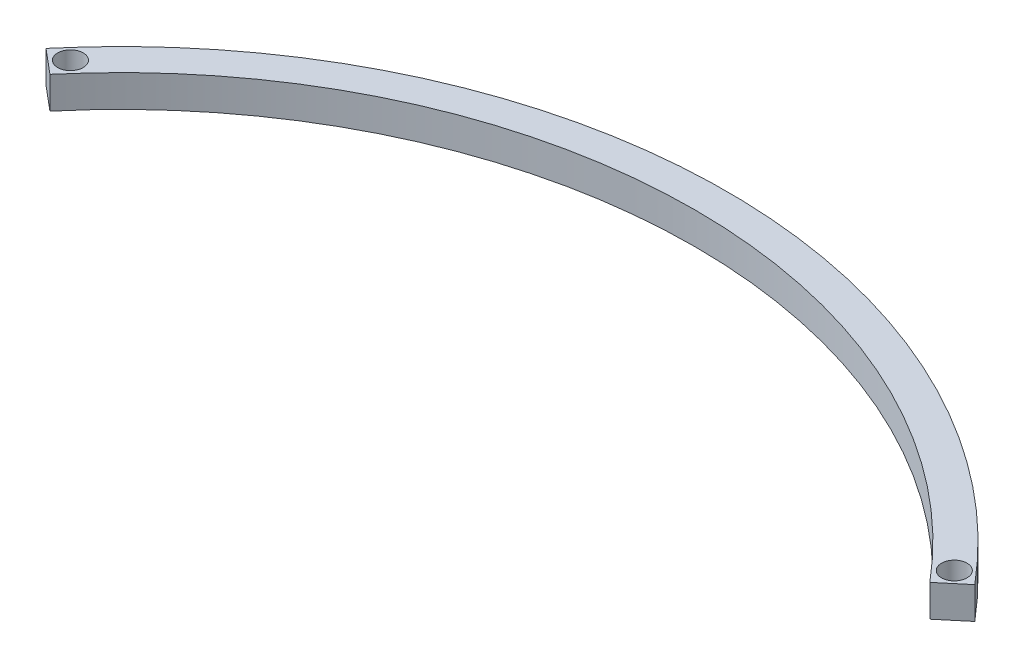
ISO-10303-21;
HEADER;
FILE_DESCRIPTION(('STEP AP214'),'2;1');
FILE_NAME('part.step','',(''),(''),'','','');
FILE_SCHEMA(('AUTOMOTIVE_DESIGN { 1 0 10303 214 1 1 1 1 }'));
ENDSEC;
DATA;
#1=APPLICATION_CONTEXT('core data for automotive mechanical design processes');
#2=APPLICATION_PROTOCOL_DEFINITION('international standard','automotive_design',2000,#1);
#3=PRODUCT_CONTEXT('',#1,'mechanical');
#4=PRODUCT('Part','Part','',(#3));
#5=PRODUCT_RELATED_PRODUCT_CATEGORY('part','',(#4));
#6=PRODUCT_DEFINITION_FORMATION('','',#4);
#7=PRODUCT_DEFINITION_CONTEXT('part definition',#1,'design');
#8=PRODUCT_DEFINITION('design','',#6,#7);
#9=PRODUCT_DEFINITION_SHAPE('','',#8);
#10=(LENGTH_UNIT() NAMED_UNIT(*) SI_UNIT(.MILLI.,.METRE.));
#11=(NAMED_UNIT(*) PLANE_ANGLE_UNIT() SI_UNIT($,.RADIAN.));
#12=(NAMED_UNIT(*) SI_UNIT($,.STERADIAN.) SOLID_ANGLE_UNIT());
#13=UNCERTAINTY_MEASURE_WITH_UNIT(LENGTH_MEASURE(1.E-05),#10,'distance_accuracy_value','');
#14=(GEOMETRIC_REPRESENTATION_CONTEXT(3) GLOBAL_UNCERTAINTY_ASSIGNED_CONTEXT((#13)) GLOBAL_UNIT_ASSIGNED_CONTEXT((#10,
#11,#12)) REPRESENTATION_CONTEXT('',''));
#15=CARTESIAN_POINT('',(0.,0.,0.));
#16=DIRECTION('',(0.,0.,1.));
#17=DIRECTION('',(1.,0.,0.));
#18=AXIS2_PLACEMENT_3D('',#15,#16,#17);
#19=CARTESIAN_POINT('',(0.,5.,0.));
#20=DIRECTION('',(0.,-1.,0.));
#21=DIRECTION('',(0.,0.,-1.));
#22=AXIS2_PLACEMENT_3D('',#19,#20,#21);
#23=PLANE('',#22);
#24=CARTESIAN_POINT('',(0.,5.,0.));
#25=DIRECTION('',(0.,1.,0.));
#26=DIRECTION('',(0.,0.,-1.));
#27=AXIS2_PLACEMENT_3D('',#24,#25,#26);
#28=CIRCLE('',#27,190.);
#29=CARTESIAN_POINT('',(145.548444192606,5.,-122.129645840443));
#30=VERTEX_POINT('',#29);
#31=CARTESIAN_POINT('',(-145.548444192606,5.,-122.129645840443));
#32=VERTEX_POINT('',#31);
#33=EDGE_CURVE('E95',#30,#32,#28,.T.);
#34=ORIENTED_EDGE('',*,*,#33,.T.);
#35=DIRECTION('',(0.766044443118977,0.,0.642787609686541));
#36=VECTOR('',#35,1.);
#37=CARTESIAN_POINT('',(-145.548444192606,5.,-122.129645840443));
#38=LINE('',#37,#36);
#39=CARTESIAN_POINT('',(-137.887999761416,5.,-115.701769743577));
#40=VERTEX_POINT('',#39);
#41=EDGE_CURVE('E90',#32,#40,#38,.T.);
#42=ORIENTED_EDGE('',*,*,#41,.T.);
#43=CARTESIAN_POINT('',(0.,5.,0.));
#44=DIRECTION('',(0.,-1.,0.));
#45=DIRECTION('',(0.,0.,-1.));
#46=AXIS2_PLACEMENT_3D('',#43,#44,#45);
#47=CIRCLE('',#46,180.);
#48=CARTESIAN_POINT('',(137.887999761416,5.,-115.701769743577));
#49=VERTEX_POINT('',#48);
#50=EDGE_CURVE('E93',#40,#49,#47,.T.);
#51=ORIENTED_EDGE('',*,*,#50,.T.);
#52=DIRECTION('',(0.766044443118975,0.,-0.642787609686543));
#53=VECTOR('',#52,1.);
#54=CARTESIAN_POINT('',(145.548444192606,5.,-122.129645840443));
#55=LINE('',#54,#53);
#56=EDGE_CURVE('E60',#49,#30,#55,.T.);
#57=ORIENTED_EDGE('',*,*,#56,.T.);
#58=EDGE_LOOP('',(#34,#42,#51,#57));
#59=FACE_BOUND('',#58,.T.);
#60=CARTESIAN_POINT('',(-138.504283928578,5.,-122.745930007605));
#61=DIRECTION('',(0.,1.,0.));
#62=DIRECTION('',(0.,0.,1.));
#63=AXIS2_PLACEMENT_3D('',#60,#61,#62);
#64=CIRCLE('',#63,3.99999999999999);
#65=CARTESIAN_POINT('',(-138.504283928578,5.,-118.745930007605));
#66=VERTEX_POINT('',#65);
#67=EDGE_CURVE('E110',#66,#66,#64,.T.);
#68=ORIENTED_EDGE('',*,*,#67,.F.);
#69=EDGE_LOOP('',(#68));
#70=FACE_BOUND('',#69,.T.);
#71=CARTESIAN_POINT('',(138.504283928578,5.,-122.745930007605));
#72=DIRECTION('',(0.,1.,0.));
#73=DIRECTION('',(0.,0.,-1.));
#74=AXIS2_PLACEMENT_3D('',#71,#72,#73);
#75=CIRCLE('',#74,3.99999999999999);
#76=CARTESIAN_POINT('',(138.504283928578,5.,-126.745930007605));
#77=VERTEX_POINT('',#76);
#78=EDGE_CURVE('E125',#77,#77,#75,.T.);
#79=ORIENTED_EDGE('',*,*,#78,.F.);
#80=EDGE_LOOP('',(#79));
#81=FACE_BOUND('',#80,.T.);
#82=ADVANCED_FACE('F43',(#59,#70,#81),#23,.F.);
#83=CARTESIAN_POINT('',(0.,-5.,0.));
#84=DIRECTION('',(0.,-1.,0.));
#85=DIRECTION('',(0.,0.,-1.));
#86=AXIS2_PLACEMENT_3D('',#83,#84,#85);
#87=PLANE('',#86);
#88=CARTESIAN_POINT('',(-138.504283928578,-5.,-122.745930007605));
#89=DIRECTION('',(0.,1.,0.));
#90=DIRECTION('',(0.,0.,1.));
#91=AXIS2_PLACEMENT_3D('',#88,#89,#90);
#92=CIRCLE('',#91,3.99999999999999);
#93=CARTESIAN_POINT('',(-138.504283928578,-5.,-118.745930007605));
#94=VERTEX_POINT('',#93);
#95=EDGE_CURVE('E122',#94,#94,#92,.T.);
#96=ORIENTED_EDGE('',*,*,#95,.T.);
#97=EDGE_LOOP('',(#96));
#98=FACE_BOUND('',#97,.T.);
#99=CARTESIAN_POINT('',(0.,-5.,0.));
#100=DIRECTION('',(0.,1.,0.));
#101=DIRECTION('',(0.,0.,-1.));
#102=AXIS2_PLACEMENT_3D('',#99,#100,#101);
#103=CIRCLE('',#102,190.);
#104=CARTESIAN_POINT('',(145.548444192606,-5.,-122.129645840443));
#105=VERTEX_POINT('',#104);
#106=CARTESIAN_POINT('',(-145.548444192606,-5.,-122.129645840443));
#107=VERTEX_POINT('',#106);
#108=EDGE_CURVE('E107',#105,#107,#103,.T.);
#109=ORIENTED_EDGE('',*,*,#108,.F.);
#110=DIRECTION('',(0.766044443118975,0.,-0.642787609686543));
#111=VECTOR('',#110,1.);
#112=CARTESIAN_POINT('',(145.548444192606,-5.,-122.129645840443));
#113=LINE('',#112,#111);
#114=CARTESIAN_POINT('',(137.887999761416,-5.,-115.701769743577));
#115=VERTEX_POINT('',#114);
#116=EDGE_CURVE('E83',#115,#105,#113,.T.);
#117=ORIENTED_EDGE('',*,*,#116,.F.);
#118=CARTESIAN_POINT('',(0.,-5.,0.));
#119=DIRECTION('',(0.,-1.,0.));
#120=DIRECTION('',(0.,0.,-1.));
#121=AXIS2_PLACEMENT_3D('',#118,#119,#120);
#122=CIRCLE('',#121,180.);
#123=CARTESIAN_POINT('',(-137.887999761416,-5.,-115.701769743577));
#124=VERTEX_POINT('',#123);
#125=EDGE_CURVE('E77',#124,#115,#122,.T.);
#126=ORIENTED_EDGE('',*,*,#125,.F.);
#127=DIRECTION('',(0.766044443118977,0.,0.642787609686541));
#128=VECTOR('',#127,1.);
#129=CARTESIAN_POINT('',(-145.548444192606,-5.,-122.129645840443));
#130=LINE('',#129,#128);
#131=EDGE_CURVE('E99',#107,#124,#130,.T.);
#132=ORIENTED_EDGE('',*,*,#131,.F.);
#133=EDGE_LOOP('',(#109,#117,#126,#132));
#134=FACE_BOUND('',#133,.T.);
#135=CARTESIAN_POINT('',(138.504283928578,-5.,-122.745930007605));
#136=DIRECTION('',(0.,1.,0.));
#137=DIRECTION('',(0.,0.,-1.));
#138=AXIS2_PLACEMENT_3D('',#135,#136,#137);
#139=CIRCLE('',#138,3.99999999999999);
#140=CARTESIAN_POINT('',(138.504283928578,-5.,-126.745930007605));
#141=VERTEX_POINT('',#140);
#142=EDGE_CURVE('E128',#141,#141,#139,.T.);
#143=ORIENTED_EDGE('',*,*,#142,.T.);
#144=EDGE_LOOP('',(#143));
#145=FACE_BOUND('',#144,.T.);
#146=ADVANCED_FACE('F118',(#98,#134,#145),#87,.T.);
#147=CARTESIAN_POINT('',(0.,5.,0.));
#148=DIRECTION('',(0.,-1.,0.));
#149=DIRECTION('',(0.,0.,-1.));
#150=AXIS2_PLACEMENT_3D('',#147,#148,#149);
#151=CYLINDRICAL_SURFACE('',#150,190.);
#152=ORIENTED_EDGE('',*,*,#108,.T.);
#153=DIRECTION('',(0.,-1.,0.));
#154=VECTOR('',#153,1.);
#155=CARTESIAN_POINT('',(-145.548444192606,5.,-122.129645840443));
#156=LINE('',#155,#154);
#157=EDGE_CURVE('E11',#32,#107,#156,.T.);
#158=ORIENTED_EDGE('',*,*,#157,.F.);
#159=ORIENTED_EDGE('',*,*,#33,.F.);
#160=DIRECTION('',(0.,-1.,0.));
#161=VECTOR('',#160,1.);
#162=CARTESIAN_POINT('',(145.548444192606,5.,-122.129645840443));
#163=LINE('',#162,#161);
#164=EDGE_CURVE('E103',#30,#105,#163,.T.);
#165=ORIENTED_EDGE('',*,*,#164,.T.);
#166=EDGE_LOOP('',(#152,#158,#159,#165));
#167=FACE_BOUND('',#166,.T.);
#168=ADVANCED_FACE('F45',(#167),#151,.T.);
#169=CARTESIAN_POINT('',(-145.548444192606,5.,-122.129645840443));
#170=DIRECTION('',(0.642787609686541,0.,-0.766044443118977));
#171=DIRECTION('',(-0.766044443118977,0.,-0.642787609686541));
#172=AXIS2_PLACEMENT_3D('',#169,#170,#171);
#173=PLANE('',#172);
#174=ORIENTED_EDGE('',*,*,#131,.T.);
#175=DIRECTION('',(0.,-1.,0.));
#176=VECTOR('',#175,1.);
#177=CARTESIAN_POINT('',(-137.887999761416,5.,-115.701769743577));
#178=LINE('',#177,#176);
#179=EDGE_CURVE('E52',#40,#124,#178,.T.);
#180=ORIENTED_EDGE('',*,*,#179,.F.);
#181=ORIENTED_EDGE('',*,*,#41,.F.);
#182=ORIENTED_EDGE('',*,*,#157,.T.);
#183=EDGE_LOOP('',(#174,#180,#181,#182));
#184=FACE_BOUND('',#183,.T.);
#185=ADVANCED_FACE('F98',(#184),#173,.F.);
#186=CARTESIAN_POINT('',(0.,5.,0.));
#187=DIRECTION('',(0.,-1.,0.));
#188=DIRECTION('',(0.,0.,-1.));
#189=AXIS2_PLACEMENT_3D('',#186,#187,#188);
#190=CYLINDRICAL_SURFACE('',#189,180.);
#191=ORIENTED_EDGE('',*,*,#125,.T.);
#192=DIRECTION('',(0.,-1.,0.));
#193=VECTOR('',#192,1.);
#194=CARTESIAN_POINT('',(137.887999761416,5.,-115.701769743577));
#195=LINE('',#194,#193);
#196=EDGE_CURVE('E100',#49,#115,#195,.T.);
#197=ORIENTED_EDGE('',*,*,#196,.F.);
#198=ORIENTED_EDGE('',*,*,#50,.F.);
#199=ORIENTED_EDGE('',*,*,#179,.T.);
#200=EDGE_LOOP('',(#191,#197,#198,#199));
#201=FACE_BOUND('',#200,.T.);
#202=ADVANCED_FACE('F101',(#201),#190,.F.);
#203=CARTESIAN_POINT('',(145.548444192606,5.,-122.129645840443));
#204=DIRECTION('',(-0.642787609686543,0.,-0.766044443118975));
#205=DIRECTION('',(-0.766044443118975,0.,0.642787609686543));
#206=AXIS2_PLACEMENT_3D('',#203,#204,#205);
#207=PLANE('',#206);
#208=ORIENTED_EDGE('',*,*,#116,.T.);
#209=ORIENTED_EDGE('',*,*,#164,.F.);
#210=ORIENTED_EDGE('',*,*,#56,.F.);
#211=ORIENTED_EDGE('',*,*,#196,.T.);
#212=EDGE_LOOP('',(#208,#209,#210,#211));
#213=FACE_BOUND('',#212,.T.);
#214=ADVANCED_FACE('F115',(#213),#207,.F.);
#215=CARTESIAN_POINT('',(-138.504283928578,5.,-122.745930007605));
#216=DIRECTION('',(0.,-1.,0.));
#217=DIRECTION('',(0.,0.,-1.));
#218=AXIS2_PLACEMENT_3D('',#215,#216,#217);
#219=CYLINDRICAL_SURFACE('',#218,3.99999999999999);
#220=ORIENTED_EDGE('',*,*,#67,.T.);
#221=EDGE_LOOP('',(#220));
#222=FACE_BOUND('',#221,.T.);
#223=ORIENTED_EDGE('',*,*,#95,.F.);
#224=EDGE_LOOP('',(#223));
#225=FACE_BOUND('',#224,.T.);
#226=ADVANCED_FACE('F145',(#222,#225),#219,.F.);
#227=CARTESIAN_POINT('',(138.504283928578,5.,-122.745930007605));
#228=DIRECTION('',(0.,-1.,0.));
#229=DIRECTION('',(0.,0.,-1.));
#230=AXIS2_PLACEMENT_3D('',#227,#228,#229);
#231=CYLINDRICAL_SURFACE('',#230,3.99999999999999);
#232=ORIENTED_EDGE('',*,*,#78,.T.);
#233=EDGE_LOOP('',(#232));
#234=FACE_BOUND('',#233,.T.);
#235=ORIENTED_EDGE('',*,*,#142,.F.);
#236=EDGE_LOOP('',(#235));
#237=FACE_BOUND('',#236,.T.);
#238=ADVANCED_FACE('F134',(#234,#237),#231,.F.);
#239=CLOSED_SHELL('',(#82,#146,#168,#185,#202,#214,#226,#238));
#240=MANIFOLD_SOLID_BREP('B2',#239);
#241=ADVANCED_BREP_SHAPE_REPRESENTATION('',(#18,#240),#14);
#242=SHAPE_DEFINITION_REPRESENTATION(#9,#241);
ENDSEC;
END-ISO-10303-21;
